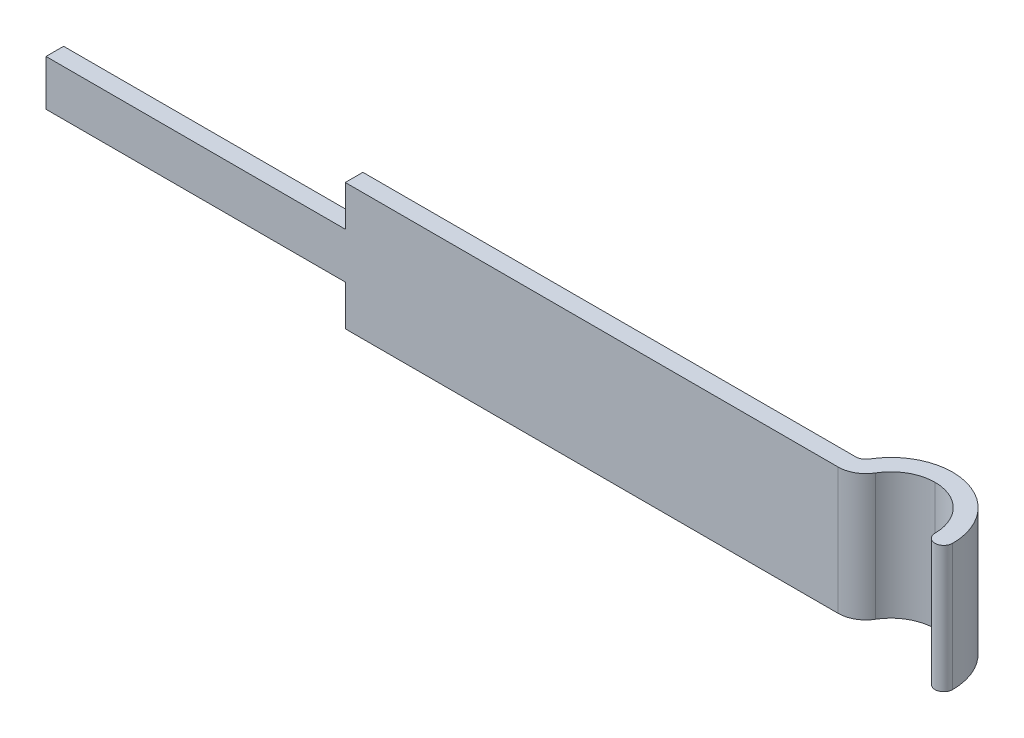
ISO-10303-21;
HEADER;
FILE_DESCRIPTION(('STEP AP214'),'2;1');
FILE_NAME('part.step','',(''),(''),'','','');
FILE_SCHEMA(('AUTOMOTIVE_DESIGN { 1 0 10303 214 1 1 1 1 }'));
ENDSEC;
DATA;
#1=APPLICATION_CONTEXT('core data for automotive mechanical design processes');
#2=APPLICATION_PROTOCOL_DEFINITION('international standard','automotive_design',2000,#1);
#3=PRODUCT_CONTEXT('',#1,'mechanical');
#4=PRODUCT('Part','Part','',(#3));
#5=PRODUCT_RELATED_PRODUCT_CATEGORY('part','',(#4));
#6=PRODUCT_DEFINITION_FORMATION('','',#4);
#7=PRODUCT_DEFINITION_CONTEXT('part definition',#1,'design');
#8=PRODUCT_DEFINITION('design','',#6,#7);
#9=PRODUCT_DEFINITION_SHAPE('','',#8);
#10=(LENGTH_UNIT() NAMED_UNIT(*) SI_UNIT(.MILLI.,.METRE.));
#11=(NAMED_UNIT(*) PLANE_ANGLE_UNIT() SI_UNIT($,.RADIAN.));
#12=(NAMED_UNIT(*) SI_UNIT($,.STERADIAN.) SOLID_ANGLE_UNIT());
#13=UNCERTAINTY_MEASURE_WITH_UNIT(LENGTH_MEASURE(1.E-05),#10,'distance_accuracy_value','');
#14=(GEOMETRIC_REPRESENTATION_CONTEXT(3) GLOBAL_UNCERTAINTY_ASSIGNED_CONTEXT((#13)) GLOBAL_UNIT_ASSIGNED_CONTEXT((#10,
#11,#12)) REPRESENTATION_CONTEXT('',''));
#15=CARTESIAN_POINT('',(0.,0.,0.));
#16=DIRECTION('',(0.,0.,1.));
#17=DIRECTION('',(1.,0.,0.));
#18=AXIS2_PLACEMENT_3D('',#15,#16,#17);
#19=CARTESIAN_POINT('',(-15.5,0.65,-1.25));
#20=DIRECTION('',(1.,0.,0.));
#21=DIRECTION('',(0.,1.,0.));
#22=AXIS2_PLACEMENT_3D('',#19,#20,#21);
#23=PLANE('',#22);
#24=DIRECTION('',(0.,0.,1.));
#25=VECTOR('',#24,1.);
#26=CARTESIAN_POINT('',(-15.5,-0.65,0.));
#27=LINE('',#26,#25);
#28=CARTESIAN_POINT('',(-15.5,-0.65,-0.250000000000007));
#29=VERTEX_POINT('',#28);
#30=CARTESIAN_POINT('',(-15.5,-0.65,0.25));
#31=VERTEX_POINT('',#30);
#32=EDGE_CURVE('E11',#29,#31,#27,.T.);
#33=ORIENTED_EDGE('',*,*,#32,.T.);
#34=DIRECTION('',(0.,1.,0.));
#35=VECTOR('',#34,1.);
#36=CARTESIAN_POINT('',(-15.5,0.65,0.249999999999994));
#37=LINE('',#36,#35);
#38=CARTESIAN_POINT('',(-15.5,0.65,0.249999999999994));
#39=VERTEX_POINT('',#38);
#40=EDGE_CURVE('E194',#31,#39,#37,.T.);
#41=ORIENTED_EDGE('',*,*,#40,.T.);
#42=DIRECTION('',(0.,0.,1.));
#43=VECTOR('',#42,1.);
#44=CARTESIAN_POINT('',(-15.5,0.65,-1.25));
#45=LINE('',#44,#43);
#46=CARTESIAN_POINT('',(-15.5,0.65,-0.250000000000004));
#47=VERTEX_POINT('',#46);
#48=EDGE_CURVE('E27',#47,#39,#45,.T.);
#49=ORIENTED_EDGE('',*,*,#48,.F.);
#50=DIRECTION('',(0.,1.,0.));
#51=VECTOR('',#50,1.);
#52=CARTESIAN_POINT('',(-15.5,1.8,-0.250000000000007));
#53=LINE('',#52,#51);
#54=EDGE_CURVE('E236',#29,#47,#53,.T.);
#55=ORIENTED_EDGE('',*,*,#54,.F.);
#56=EDGE_LOOP('',(#33,#41,#49,#55));
#57=FACE_BOUND('',#56,.T.);
#58=ADVANCED_FACE('F16',(#57),#23,.F.);
#59=CARTESIAN_POINT('',(0.,-0.65,0.));
#60=DIRECTION('',(0.,-1.,0.));
#61=DIRECTION('',(-1.,0.,0.));
#62=AXIS2_PLACEMENT_3D('',#59,#60,#61);
#63=PLANE('',#62);
#64=ORIENTED_EDGE('',*,*,#32,.F.);
#65=DIRECTION('',(-1.,0.,0.));
#66=VECTOR('',#65,1.);
#67=CARTESIAN_POINT('',(-7.,-0.65,-0.250000000000007));
#68=LINE('',#67,#66);
#69=CARTESIAN_POINT('',(-7.,-0.65,-0.250000000000007));
#70=VERTEX_POINT('',#69);
#71=EDGE_CURVE('E241',#70,#29,#68,.T.);
#72=ORIENTED_EDGE('',*,*,#71,.F.);
#73=DIRECTION('',(0.,0.,-1.));
#74=VECTOR('',#73,1.);
#75=CARTESIAN_POINT('',(-7.,-0.65,-0.250000000000007));
#76=LINE('',#75,#74);
#77=CARTESIAN_POINT('',(-7.,-0.65,0.25));
#78=VERTEX_POINT('',#77);
#79=EDGE_CURVE('E160',#78,#70,#76,.T.);
#80=ORIENTED_EDGE('',*,*,#79,.F.);
#81=DIRECTION('',(1.,0.,0.));
#82=VECTOR('',#81,1.);
#83=CARTESIAN_POINT('',(-7.,-0.65,0.25));
#84=LINE('',#83,#82);
#85=EDGE_CURVE('E148',#31,#78,#84,.T.);
#86=ORIENTED_EDGE('',*,*,#85,.F.);
#87=EDGE_LOOP('',(#64,#72,#80,#86));
#88=FACE_BOUND('',#87,.T.);
#89=ADVANCED_FACE('F18',(#88),#63,.T.);
#90=CARTESIAN_POINT('',(0.,0.65,0.));
#91=DIRECTION('',(0.,-1.,0.));
#92=DIRECTION('',(-1.,0.,0.));
#93=AXIS2_PLACEMENT_3D('',#90,#91,#92);
#94=PLANE('',#93);
#95=DIRECTION('',(-1.,0.,0.));
#96=VECTOR('',#95,1.);
#97=CARTESIAN_POINT('',(-7.,0.65,-0.250000000000004));
#98=LINE('',#97,#96);
#99=CARTESIAN_POINT('',(-7.,0.65,-0.250000000000004));
#100=VERTEX_POINT('',#99);
#101=EDGE_CURVE('E240',#100,#47,#98,.T.);
#102=ORIENTED_EDGE('',*,*,#101,.T.);
#103=ORIENTED_EDGE('',*,*,#48,.T.);
#104=DIRECTION('',(1.,0.,0.));
#105=VECTOR('',#104,1.);
#106=CARTESIAN_POINT('',(-7.,0.65,0.249999999999997));
#107=LINE('',#106,#105);
#108=CARTESIAN_POINT('',(-7.,0.65,0.249999999999997));
#109=VERTEX_POINT('',#108);
#110=EDGE_CURVE('E159',#39,#109,#107,.T.);
#111=ORIENTED_EDGE('',*,*,#110,.T.);
#112=DIRECTION('',(0.,0.,-1.));
#113=VECTOR('',#112,1.);
#114=CARTESIAN_POINT('',(-7.,0.65,-0.250000000000004));
#115=LINE('',#114,#113);
#116=EDGE_CURVE('E214',#109,#100,#115,.T.);
#117=ORIENTED_EDGE('',*,*,#116,.T.);
#118=EDGE_LOOP('',(#102,#103,#111,#117));
#119=FACE_BOUND('',#118,.T.);
#120=ADVANCED_FACE('F290',(#119),#94,.F.);
#121=CARTESIAN_POINT('',(7.,-1.8,-0.53125));
#122=DIRECTION('',(0.,1.,0.));
#123=DIRECTION('',(1.,0.,0.));
#124=AXIS2_PLACEMENT_3D('',#121,#122,#123);
#125=PLANE('',#124);
#126=CARTESIAN_POINT('',(7.,-1.8,-0.53125));
#127=DIRECTION('',(0.,-1.,0.));
#128=DIRECTION('',(0.,0.,1.));
#129=AXIS2_PLACEMENT_3D('',#126,#127,#128);
#130=CIRCLE('',#129,0.28125);
#131=CARTESIAN_POINT('',(7.24230769230769,-1.8,-0.388461538461542));
#132=VERTEX_POINT('',#131);
#133=CARTESIAN_POINT('',(7.,-1.8,-0.250000000000004));
#134=VERTEX_POINT('',#133);
#135=EDGE_CURVE('E207',#132,#134,#130,.T.);
#136=ORIENTED_EDGE('',*,*,#135,.F.);
#137=CARTESIAN_POINT('',(8.75,-1.8,0.5));
#138=DIRECTION('',(0.,1.,0.));
#139=DIRECTION('',(0.,0.,-1.));
#140=AXIS2_PLACEMENT_3D('',#137,#138,#139);
#141=CIRCLE('',#140,1.75);
#142=CARTESIAN_POINT('',(8.75,-1.8,-1.25));
#143=VERTEX_POINT('',#142);
#144=EDGE_CURVE('E220',#143,#132,#141,.T.);
#145=ORIENTED_EDGE('',*,*,#144,.F.);
#146=CARTESIAN_POINT('',(8.75,-1.8,0.5));
#147=DIRECTION('',(0.,1.,0.));
#148=DIRECTION('',(0.,0.,-1.));
#149=AXIS2_PLACEMENT_3D('',#146,#147,#148);
#150=CIRCLE('',#149,1.75);
#151=CARTESIAN_POINT('',(10.5,-1.8,0.5));
#152=VERTEX_POINT('',#151);
#153=EDGE_CURVE('E226',#152,#143,#150,.T.);
#154=ORIENTED_EDGE('',*,*,#153,.F.);
#155=CARTESIAN_POINT('',(10.25,-1.8,0.5));
#156=DIRECTION('',(0.,1.,0.));
#157=DIRECTION('',(0.,0.,1.));
#158=AXIS2_PLACEMENT_3D('',#155,#156,#157);
#159=CIRCLE('',#158,0.25);
#160=CARTESIAN_POINT('',(10.,-1.8,0.5));
#161=VERTEX_POINT('',#160);
#162=EDGE_CURVE('E232',#161,#152,#159,.T.);
#163=ORIENTED_EDGE('',*,*,#162,.F.);
#164=CARTESIAN_POINT('',(8.75,-1.8,0.5));
#165=DIRECTION('',(0.,-1.,0.));
#166=DIRECTION('',(0.,0.,-1.));
#167=AXIS2_PLACEMENT_3D('',#164,#165,#166);
#168=CIRCLE('',#167,1.25);
#169=CARTESIAN_POINT('',(8.75,-1.8,-0.75));
#170=VERTEX_POINT('',#169);
#171=EDGE_CURVE('E196',#170,#161,#168,.T.);
#172=ORIENTED_EDGE('',*,*,#171,.F.);
#173=CARTESIAN_POINT('',(8.75,-1.8,0.5));
#174=DIRECTION('',(0.,-1.,0.));
#175=DIRECTION('',(0.,0.,-1.));
#176=AXIS2_PLACEMENT_3D('',#173,#174,#175);
#177=CIRCLE('',#176,1.25);
#178=CARTESIAN_POINT('',(7.67307692307692,-1.8,-0.134615384615386));
#179=VERTEX_POINT('',#178);
#180=EDGE_CURVE('E235',#179,#170,#177,.T.);
#181=ORIENTED_EDGE('',*,*,#180,.F.);
#182=CARTESIAN_POINT('',(7.,-1.8,-0.53125));
#183=DIRECTION('',(0.,1.,0.));
#184=DIRECTION('',(0.,0.,1.));
#185=AXIS2_PLACEMENT_3D('',#182,#183,#184);
#186=CIRCLE('',#185,0.78125);
#187=CARTESIAN_POINT('',(7.,-1.8,0.249999999999997));
#188=VERTEX_POINT('',#187);
#189=EDGE_CURVE('E141',#188,#179,#186,.T.);
#190=ORIENTED_EDGE('',*,*,#189,.F.);
#191=DIRECTION('',(1.,0.,0.));
#192=VECTOR('',#191,1.);
#193=CARTESIAN_POINT('',(-7.,-1.8,0.249999999999994));
#194=LINE('',#193,#192);
#195=CARTESIAN_POINT('',(-7.,-1.8,0.249999999999994));
#196=VERTEX_POINT('',#195);
#197=EDGE_CURVE('E135',#196,#188,#194,.T.);
#198=ORIENTED_EDGE('',*,*,#197,.F.);
#199=DIRECTION('',(0.,0.,1.));
#200=VECTOR('',#199,1.);
#201=CARTESIAN_POINT('',(-7.,-1.8,0.249999999999994));
#202=LINE('',#201,#200);
#203=CARTESIAN_POINT('',(-7.,-1.8,-0.250000000000007));
#204=VERTEX_POINT('',#203);
#205=EDGE_CURVE('E138',#204,#196,#202,.T.);
#206=ORIENTED_EDGE('',*,*,#205,.F.);
#207=DIRECTION('',(-1.,0.,0.));
#208=VECTOR('',#207,1.);
#209=CARTESIAN_POINT('',(-7.,-1.8,-0.250000000000007));
#210=LINE('',#209,#208);
#211=EDGE_CURVE('E175',#134,#204,#210,.T.);
#212=ORIENTED_EDGE('',*,*,#211,.F.);
#213=EDGE_LOOP('',(#136,#145,#154,#163,#172,#181,#190,#198,#206,#212));
#214=FACE_BOUND('',#213,.T.);
#215=ADVANCED_FACE('F137',(#214),#125,.F.);
#216=CARTESIAN_POINT('',(7.,1.8,-0.53125));
#217=DIRECTION('',(0.,1.,0.));
#218=DIRECTION('',(1.,0.,0.));
#219=AXIS2_PLACEMENT_3D('',#216,#217,#218);
#220=PLANE('',#219);
#221=CARTESIAN_POINT('',(7.,1.8,-0.53125));
#222=DIRECTION('',(0.,-1.,0.));
#223=DIRECTION('',(0.,0.,1.));
#224=AXIS2_PLACEMENT_3D('',#221,#222,#223);
#225=CIRCLE('',#224,0.28125);
#226=CARTESIAN_POINT('',(7.24230769230768,1.8,-0.388461538461539));
#227=VERTEX_POINT('',#226);
#228=CARTESIAN_POINT('',(7.,1.8,-0.25));
#229=VERTEX_POINT('',#228);
#230=EDGE_CURVE('E206',#227,#229,#225,.T.);
#231=ORIENTED_EDGE('',*,*,#230,.T.);
#232=DIRECTION('',(-1.,0.,0.));
#233=VECTOR('',#232,1.);
#234=CARTESIAN_POINT('',(-7.,1.8,-0.250000000000004));
#235=LINE('',#234,#233);
#236=CARTESIAN_POINT('',(-7.,1.8,-0.250000000000004));
#237=VERTEX_POINT('',#236);
#238=EDGE_CURVE('E247',#229,#237,#235,.T.);
#239=ORIENTED_EDGE('',*,*,#238,.T.);
#240=DIRECTION('',(0.,0.,1.));
#241=VECTOR('',#240,1.);
#242=CARTESIAN_POINT('',(-7.,1.8,0.249999999999997));
#243=LINE('',#242,#241);
#244=CARTESIAN_POINT('',(-7.,1.8,0.249999999999997));
#245=VERTEX_POINT('',#244);
#246=EDGE_CURVE('E187',#237,#245,#243,.T.);
#247=ORIENTED_EDGE('',*,*,#246,.T.);
#248=DIRECTION('',(1.,0.,0.));
#249=VECTOR('',#248,1.);
#250=CARTESIAN_POINT('',(-7.,1.8,0.249999999999997));
#251=LINE('',#250,#249);
#252=CARTESIAN_POINT('',(7.,1.8,0.25));
#253=VERTEX_POINT('',#252);
#254=EDGE_CURVE('E210',#245,#253,#251,.T.);
#255=ORIENTED_EDGE('',*,*,#254,.T.);
#256=CARTESIAN_POINT('',(7.,1.8,-0.53125));
#257=DIRECTION('',(0.,1.,0.));
#258=DIRECTION('',(0.,0.,1.));
#259=AXIS2_PLACEMENT_3D('',#256,#257,#258);
#260=CIRCLE('',#259,0.78125);
#261=CARTESIAN_POINT('',(7.67307692307692,1.8,-0.134615384615386));
#262=VERTEX_POINT('',#261);
#263=EDGE_CURVE('E181',#253,#262,#260,.T.);
#264=ORIENTED_EDGE('',*,*,#263,.T.);
#265=CARTESIAN_POINT('',(8.75,1.8,0.5));
#266=DIRECTION('',(0.,-1.,0.));
#267=DIRECTION('',(0.,0.,-1.));
#268=AXIS2_PLACEMENT_3D('',#265,#266,#267);
#269=CIRCLE('',#268,1.25);
#270=CARTESIAN_POINT('',(8.75,1.8,-0.75));
#271=VERTEX_POINT('',#270);
#272=EDGE_CURVE('E185',#262,#271,#269,.T.);
#273=ORIENTED_EDGE('',*,*,#272,.T.);
#274=CARTESIAN_POINT('',(8.75,1.8,0.5));
#275=DIRECTION('',(0.,-1.,0.));
#276=DIRECTION('',(0.,0.,-1.));
#277=AXIS2_PLACEMENT_3D('',#274,#275,#276);
#278=CIRCLE('',#277,1.25);
#279=CARTESIAN_POINT('',(10.,1.8,0.5));
#280=VERTEX_POINT('',#279);
#281=EDGE_CURVE('E274',#271,#280,#278,.T.);
#282=ORIENTED_EDGE('',*,*,#281,.T.);
#283=CARTESIAN_POINT('',(10.25,1.8,0.5));
#284=DIRECTION('',(0.,1.,0.));
#285=DIRECTION('',(0.,0.,1.));
#286=AXIS2_PLACEMENT_3D('',#283,#284,#285);
#287=CIRCLE('',#286,0.25);
#288=CARTESIAN_POINT('',(10.5,1.8,0.5));
#289=VERTEX_POINT('',#288);
#290=EDGE_CURVE('E20',#280,#289,#287,.T.);
#291=ORIENTED_EDGE('',*,*,#290,.T.);
#292=CARTESIAN_POINT('',(8.75,1.8,0.5));
#293=DIRECTION('',(0.,1.,0.));
#294=DIRECTION('',(0.,0.,-1.));
#295=AXIS2_PLACEMENT_3D('',#292,#293,#294);
#296=CIRCLE('',#295,1.75);
#297=CARTESIAN_POINT('',(8.75,1.8,-1.25));
#298=VERTEX_POINT('',#297);
#299=EDGE_CURVE('E42',#289,#298,#296,.T.);
#300=ORIENTED_EDGE('',*,*,#299,.T.);
#301=CARTESIAN_POINT('',(8.75,1.8,0.5));
#302=DIRECTION('',(0.,1.,0.));
#303=DIRECTION('',(0.,0.,-1.));
#304=AXIS2_PLACEMENT_3D('',#301,#302,#303);
#305=CIRCLE('',#304,1.75);
#306=EDGE_CURVE('E215',#298,#227,#305,.T.);
#307=ORIENTED_EDGE('',*,*,#306,.T.);
#308=EDGE_LOOP('',(#231,#239,#247,#255,#264,#273,#282,#291,#300,#307));
#309=FACE_BOUND('',#308,.T.);
#310=ADVANCED_FACE('F552',(#309),#220,.T.);
#311=CARTESIAN_POINT('',(8.75,1.8,0.5));
#312=DIRECTION('',(0.,-1.,0.));
#313=DIRECTION('',(0.,0.,-1.));
#314=AXIS2_PLACEMENT_3D('',#311,#312,#313);
#315=CYLINDRICAL_SURFACE('',#314,1.75);
#316=DIRECTION('',(0.,-1.,0.));
#317=VECTOR('',#316,1.);
#318=CARTESIAN_POINT('',(8.75,1.8,-1.25));
#319=LINE('',#318,#317);
#320=EDGE_CURVE('E219',#298,#143,#319,.T.);
#321=ORIENTED_EDGE('',*,*,#320,.F.);
#322=ORIENTED_EDGE('',*,*,#299,.F.);
#323=DIRECTION('',(0.,-1.,0.));
#324=VECTOR('',#323,1.);
#325=CARTESIAN_POINT('',(10.5,1.8,0.5));
#326=LINE('',#325,#324);
#327=EDGE_CURVE('E229',#289,#152,#326,.T.);
#328=ORIENTED_EDGE('',*,*,#327,.T.);
#329=ORIENTED_EDGE('',*,*,#153,.T.);
#330=EDGE_LOOP('',(#321,#322,#328,#329));
#331=FACE_BOUND('',#330,.T.);
#332=ADVANCED_FACE('F546',(#331),#315,.T.);
#333=CARTESIAN_POINT('',(10.25,1.8,0.5));
#334=DIRECTION('',(0.,-1.,0.));
#335=DIRECTION('',(0.,0.,-1.));
#336=AXIS2_PLACEMENT_3D('',#333,#334,#335);
#337=CYLINDRICAL_SURFACE('',#336,0.25);
#338=ORIENTED_EDGE('',*,*,#162,.T.);
#339=ORIENTED_EDGE('',*,*,#327,.F.);
#340=ORIENTED_EDGE('',*,*,#290,.F.);
#341=DIRECTION('',(0.,-1.,0.));
#342=VECTOR('',#341,1.);
#343=CARTESIAN_POINT('',(10.,1.8,0.5));
#344=LINE('',#343,#342);
#345=EDGE_CURVE('E200',#280,#161,#344,.T.);
#346=ORIENTED_EDGE('',*,*,#345,.T.);
#347=EDGE_LOOP('',(#338,#339,#340,#346));
#348=FACE_BOUND('',#347,.T.);
#349=ADVANCED_FACE('F542',(#348),#337,.T.);
#350=CARTESIAN_POINT('',(8.75,1.8,0.5));
#351=DIRECTION('',(0.,-1.,0.));
#352=DIRECTION('',(0.,0.,-1.));
#353=AXIS2_PLACEMENT_3D('',#350,#351,#352);
#354=CYLINDRICAL_SURFACE('',#353,1.25);
#355=DIRECTION('',(0.,-1.,0.));
#356=VECTOR('',#355,1.);
#357=CARTESIAN_POINT('',(8.75,1.8,-0.75));
#358=LINE('',#357,#356);
#359=EDGE_CURVE('E201',#271,#170,#358,.T.);
#360=ORIENTED_EDGE('',*,*,#359,.F.);
#361=ORIENTED_EDGE('',*,*,#272,.F.);
#362=DIRECTION('',(0.,-1.,0.));
#363=VECTOR('',#362,1.);
#364=CARTESIAN_POINT('',(7.67307692307692,1.8,-0.134615384615386));
#365=LINE('',#364,#363);
#366=EDGE_CURVE('E186',#262,#179,#365,.T.);
#367=ORIENTED_EDGE('',*,*,#366,.T.);
#368=ORIENTED_EDGE('',*,*,#180,.T.);
#369=EDGE_LOOP('',(#360,#361,#367,#368));
#370=FACE_BOUND('',#369,.T.);
#371=ADVANCED_FACE('F522',(#370),#354,.F.);
#372=CARTESIAN_POINT('',(7.,1.8,-0.53125));
#373=DIRECTION('',(0.,-1.,0.));
#374=DIRECTION('',(0.,0.,-1.));
#375=AXIS2_PLACEMENT_3D('',#372,#373,#374);
#376=CYLINDRICAL_SURFACE('',#375,0.78125);
#377=ORIENTED_EDGE('',*,*,#189,.T.);
#378=ORIENTED_EDGE('',*,*,#366,.F.);
#379=ORIENTED_EDGE('',*,*,#263,.F.);
#380=DIRECTION('',(0.,-1.,0.));
#381=VECTOR('',#380,1.);
#382=CARTESIAN_POINT('',(7.,1.8,0.25));
#383=LINE('',#382,#381);
#384=EDGE_CURVE('E147',#253,#188,#383,.T.);
#385=ORIENTED_EDGE('',*,*,#384,.T.);
#386=EDGE_LOOP('',(#377,#378,#379,#385));
#387=FACE_BOUND('',#386,.T.);
#388=ADVANCED_FACE('F518',(#387),#376,.T.);
#389=CARTESIAN_POINT('',(-7.,1.8,0.249999999999997));
#390=DIRECTION('',(0.,0.,-1.));
#391=DIRECTION('',(0.,-1.,0.));
#392=AXIS2_PLACEMENT_3D('',#389,#390,#391);
#393=PLANE('',#392);
#394=ORIENTED_EDGE('',*,*,#110,.F.);
#395=ORIENTED_EDGE('',*,*,#40,.F.);
#396=ORIENTED_EDGE('',*,*,#85,.T.);
#397=DIRECTION('',(0.,-1.,0.));
#398=VECTOR('',#397,1.);
#399=CARTESIAN_POINT('',(-7.,1.8,0.249999999999997));
#400=LINE('',#399,#398);
#401=EDGE_CURVE('E154',#78,#196,#400,.T.);
#402=ORIENTED_EDGE('',*,*,#401,.T.);
#403=ORIENTED_EDGE('',*,*,#197,.T.);
#404=ORIENTED_EDGE('',*,*,#384,.F.);
#405=ORIENTED_EDGE('',*,*,#254,.F.);
#406=DIRECTION('',(0.,-1.,0.));
#407=VECTOR('',#406,1.);
#408=CARTESIAN_POINT('',(-7.,1.8,0.249999999999997));
#409=LINE('',#408,#407);
#410=EDGE_CURVE('E192',#245,#109,#409,.T.);
#411=ORIENTED_EDGE('',*,*,#410,.T.);
#412=EDGE_LOOP('',(#394,#395,#396,#402,#403,#404,#405,#411));
#413=FACE_BOUND('',#412,.T.);
#414=ADVANCED_FACE('F163',(#413),#393,.F.);
#415=CARTESIAN_POINT('',(-7.,1.8,0.249999999999997));
#416=DIRECTION('',(1.,0.,0.));
#417=DIRECTION('',(0.,1.,0.));
#418=AXIS2_PLACEMENT_3D('',#415,#416,#417);
#419=PLANE('',#418);
#420=ORIENTED_EDGE('',*,*,#401,.F.);
#421=ORIENTED_EDGE('',*,*,#79,.T.);
#422=DIRECTION('',(0.,-1.,0.));
#423=VECTOR('',#422,1.);
#424=CARTESIAN_POINT('',(-7.,1.8,-0.250000000000004));
#425=LINE('',#424,#423);
#426=EDGE_CURVE('E156',#70,#204,#425,.T.);
#427=ORIENTED_EDGE('',*,*,#426,.T.);
#428=ORIENTED_EDGE('',*,*,#205,.T.);
#429=EDGE_LOOP('',(#420,#421,#427,#428));
#430=FACE_BOUND('',#429,.T.);
#431=ADVANCED_FACE('F152',(#430),#419,.F.);
#432=CARTESIAN_POINT('',(-7.,1.8,-0.250000000000004));
#433=DIRECTION('',(0.,0.,1.));
#434=DIRECTION('',(1.,0.,0.));
#435=AXIS2_PLACEMENT_3D('',#432,#433,#434);
#436=PLANE('',#435);
#437=ORIENTED_EDGE('',*,*,#71,.T.);
#438=ORIENTED_EDGE('',*,*,#54,.T.);
#439=ORIENTED_EDGE('',*,*,#101,.F.);
#440=DIRECTION('',(0.,-1.,0.));
#441=VECTOR('',#440,1.);
#442=CARTESIAN_POINT('',(-7.,1.8,-0.250000000000004));
#443=LINE('',#442,#441);
#444=EDGE_CURVE('E191',#237,#100,#443,.T.);
#445=ORIENTED_EDGE('',*,*,#444,.F.);
#446=ORIENTED_EDGE('',*,*,#238,.F.);
#447=DIRECTION('',(0.,-1.,0.));
#448=VECTOR('',#447,1.);
#449=CARTESIAN_POINT('',(7.,1.8,-0.25));
#450=LINE('',#449,#448);
#451=EDGE_CURVE('E202',#229,#134,#450,.T.);
#452=ORIENTED_EDGE('',*,*,#451,.T.);
#453=ORIENTED_EDGE('',*,*,#211,.T.);
#454=ORIENTED_EDGE('',*,*,#426,.F.);
#455=EDGE_LOOP('',(#437,#438,#439,#445,#446,#452,#453,#454));
#456=FACE_BOUND('',#455,.T.);
#457=ADVANCED_FACE('F299',(#456),#436,.F.);
#458=CARTESIAN_POINT('',(7.,1.8,-0.53125));
#459=DIRECTION('',(0.,-1.,0.));
#460=DIRECTION('',(0.,0.,-1.));
#461=AXIS2_PLACEMENT_3D('',#458,#459,#460);
#462=CYLINDRICAL_SURFACE('',#461,0.28125);
#463=ORIENTED_EDGE('',*,*,#135,.T.);
#464=ORIENTED_EDGE('',*,*,#451,.F.);
#465=ORIENTED_EDGE('',*,*,#230,.F.);
#466=DIRECTION('',(0.,-1.,0.));
#467=VECTOR('',#466,1.);
#468=CARTESIAN_POINT('',(7.24230769230768,1.8,-0.388461538461539));
#469=LINE('',#468,#467);
#470=EDGE_CURVE('E179',#227,#132,#469,.T.);
#471=ORIENTED_EDGE('',*,*,#470,.T.);
#472=EDGE_LOOP('',(#463,#464,#465,#471));
#473=FACE_BOUND('',#472,.T.);
#474=ADVANCED_FACE('F329',(#473),#462,.F.);
#475=CARTESIAN_POINT('',(-7.,1.8,0.249999999999997));
#476=DIRECTION('',(1.,0.,0.));
#477=DIRECTION('',(0.,1.,0.));
#478=AXIS2_PLACEMENT_3D('',#475,#476,#477);
#479=PLANE('',#478);
#480=ORIENTED_EDGE('',*,*,#116,.F.);
#481=ORIENTED_EDGE('',*,*,#410,.F.);
#482=ORIENTED_EDGE('',*,*,#246,.F.);
#483=ORIENTED_EDGE('',*,*,#444,.T.);
#484=EDGE_LOOP('',(#480,#481,#482,#483));
#485=FACE_BOUND('',#484,.T.);
#486=ADVANCED_FACE('F294',(#485),#479,.F.);
#487=CARTESIAN_POINT('',(8.75,1.8,0.5));
#488=DIRECTION('',(0.,-1.,0.));
#489=DIRECTION('',(0.,0.,-1.));
#490=AXIS2_PLACEMENT_3D('',#487,#488,#489);
#491=CYLINDRICAL_SURFACE('',#490,1.25);
#492=ORIENTED_EDGE('',*,*,#281,.F.);
#493=ORIENTED_EDGE('',*,*,#359,.T.);
#494=ORIENTED_EDGE('',*,*,#171,.T.);
#495=ORIENTED_EDGE('',*,*,#345,.F.);
#496=EDGE_LOOP('',(#492,#493,#494,#495));
#497=FACE_BOUND('',#496,.T.);
#498=ADVANCED_FACE('F513',(#497),#491,.F.);
#499=CARTESIAN_POINT('',(8.75,1.8,0.5));
#500=DIRECTION('',(0.,-1.,0.));
#501=DIRECTION('',(0.,0.,-1.));
#502=AXIS2_PLACEMENT_3D('',#499,#500,#501);
#503=CYLINDRICAL_SURFACE('',#502,1.75);
#504=ORIENTED_EDGE('',*,*,#306,.F.);
#505=ORIENTED_EDGE('',*,*,#320,.T.);
#506=ORIENTED_EDGE('',*,*,#144,.T.);
#507=ORIENTED_EDGE('',*,*,#470,.F.);
#508=EDGE_LOOP('',(#504,#505,#506,#507));
#509=FACE_BOUND('',#508,.T.);
#510=ADVANCED_FACE('F333',(#509),#503,.T.);
#511=CLOSED_SHELL('',(#58,#89,#120,#215,#310,#332,#349,#371,#388,#414,#431,#457,#474,#486,#498,#510));
#512=MANIFOLD_SOLID_BREP('B1',#511);
#513=ADVANCED_BREP_SHAPE_REPRESENTATION('',(#18,#512),#14);
#514=SHAPE_DEFINITION_REPRESENTATION(#9,#513);
ENDSEC;
END-ISO-10303-21;
